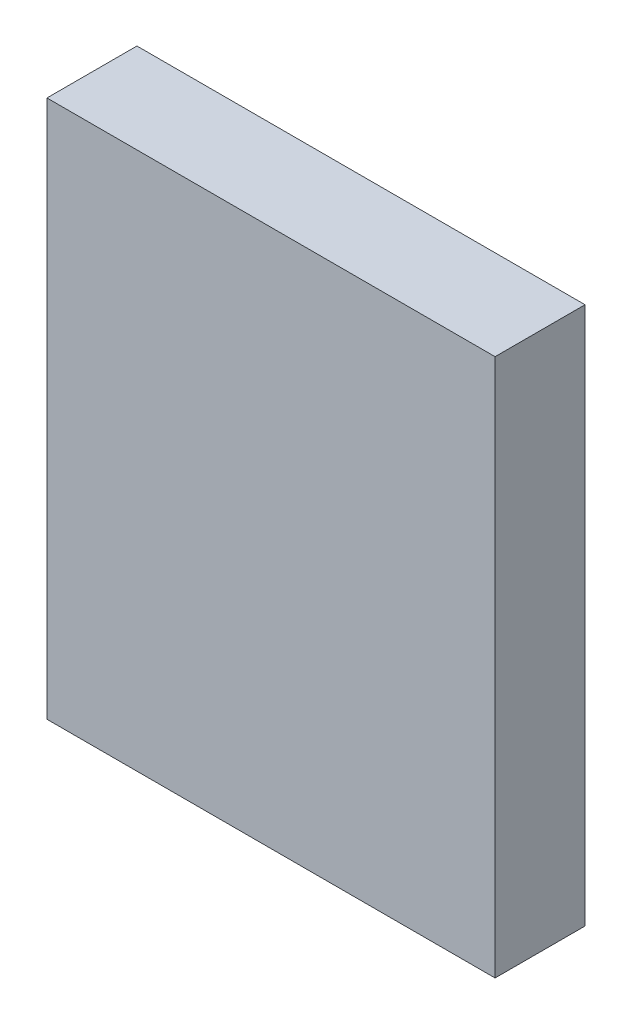
ISO-10303-21;
HEADER;
FILE_DESCRIPTION(('STEP AP214'),'2;1');
FILE_NAME('part.step','',(''),(''),'','','');
FILE_SCHEMA(('AUTOMOTIVE_DESIGN { 1 0 10303 214 1 1 1 1 }'));
ENDSEC;
DATA;
#1=APPLICATION_CONTEXT('core data for automotive mechanical design processes');
#2=APPLICATION_PROTOCOL_DEFINITION('international standard','automotive_design',2000,#1);
#3=PRODUCT_CONTEXT('',#1,'mechanical');
#4=PRODUCT('Part','Part','',(#3));
#5=PRODUCT_RELATED_PRODUCT_CATEGORY('part','',(#4));
#6=PRODUCT_DEFINITION_FORMATION('','',#4);
#7=PRODUCT_DEFINITION_CONTEXT('part definition',#1,'design');
#8=PRODUCT_DEFINITION('design','',#6,#7);
#9=PRODUCT_DEFINITION_SHAPE('','',#8);
#10=(LENGTH_UNIT() NAMED_UNIT(*) SI_UNIT(.MILLI.,.METRE.));
#11=(NAMED_UNIT(*) PLANE_ANGLE_UNIT() SI_UNIT($,.RADIAN.));
#12=(NAMED_UNIT(*) SI_UNIT($,.STERADIAN.) SOLID_ANGLE_UNIT());
#13=UNCERTAINTY_MEASURE_WITH_UNIT(LENGTH_MEASURE(1.E-05),#10,'distance_accuracy_value','');
#14=(GEOMETRIC_REPRESENTATION_CONTEXT(3) GLOBAL_UNCERTAINTY_ASSIGNED_CONTEXT((#13)) GLOBAL_UNIT_ASSIGNED_CONTEXT((#10,
#11,#12)) REPRESENTATION_CONTEXT('',''));
#15=CARTESIAN_POINT('',(0.,0.,0.));
#16=DIRECTION('',(0.,0.,1.));
#17=DIRECTION('',(1.,0.,0.));
#18=AXIS2_PLACEMENT_3D('',#15,#16,#17);
#19=CARTESIAN_POINT('',(-0.627,0.698,0.));
#20=DIRECTION('',(0.,-1.,0.));
#21=DIRECTION('',(0.,0.,1.));
#22=AXIS2_PLACEMENT_3D('',#19,#20,#21);
#23=PLANE('',#22);
#24=DIRECTION('',(-1.,0.,0.));
#25=VECTOR('',#24,1.);
#26=CARTESIAN_POINT('',(-0.373,0.698,0.));
#27=LINE('',#26,#25);
#28=CARTESIAN_POINT('',(-0.373,0.698,0.));
#29=VERTEX_POINT('',#28);
#30=CARTESIAN_POINT('',(-0.627,0.698,0.));
#31=VERTEX_POINT('',#30);
#32=EDGE_CURVE('E11',#29,#31,#27,.T.);
#33=ORIENTED_EDGE('',*,*,#32,.F.);
#34=DIRECTION('',(0.,0.,-1.));
#35=VECTOR('',#34,1.);
#36=CARTESIAN_POINT('',(-0.373,0.698,0.051));
#37=LINE('',#36,#35);
#38=CARTESIAN_POINT('',(-0.373,0.698,0.051));
#39=VERTEX_POINT('',#38);
#40=EDGE_CURVE('E24',#39,#29,#37,.T.);
#41=ORIENTED_EDGE('',*,*,#40,.F.);
#42=DIRECTION('',(1.,0.,0.));
#43=VECTOR('',#42,1.);
#44=CARTESIAN_POINT('',(-0.627,0.698,0.051));
#45=LINE('',#44,#43);
#46=CARTESIAN_POINT('',(-0.627,0.698,0.051));
#47=VERTEX_POINT('',#46);
#48=EDGE_CURVE('E88',#47,#39,#45,.T.);
#49=ORIENTED_EDGE('',*,*,#48,.F.);
#50=DIRECTION('',(0.,0.,1.));
#51=VECTOR('',#50,1.);
#52=CARTESIAN_POINT('',(-0.627,0.698,0.));
#53=LINE('',#52,#51);
#54=EDGE_CURVE('E77',#31,#47,#53,.T.);
#55=ORIENTED_EDGE('',*,*,#54,.F.);
#56=EDGE_LOOP('',(#33,#41,#49,#55));
#57=FACE_BOUND('',#56,.T.);
#58=ADVANCED_FACE('F17',(#57),#23,.T.);
#59=CARTESIAN_POINT('',(-0.373,0.698,0.));
#60=DIRECTION('',(1.,0.,0.));
#61=DIRECTION('',(0.,0.,1.));
#62=AXIS2_PLACEMENT_3D('',#59,#60,#61);
#63=PLANE('',#62);
#64=DIRECTION('',(0.,-1.,0.));
#65=VECTOR('',#64,1.);
#66=CARTESIAN_POINT('',(-0.373,1.003,0.));
#67=LINE('',#66,#65);
#68=CARTESIAN_POINT('',(-0.373,1.003,0.));
#69=VERTEX_POINT('',#68);
#70=EDGE_CURVE('E85',#69,#29,#67,.T.);
#71=ORIENTED_EDGE('',*,*,#70,.F.);
#72=DIRECTION('',(0.,0.,-1.));
#73=VECTOR('',#72,1.);
#74=CARTESIAN_POINT('',(-0.373,1.003,0.051));
#75=LINE('',#74,#73);
#76=CARTESIAN_POINT('',(-0.373,1.003,0.051));
#77=VERTEX_POINT('',#76);
#78=EDGE_CURVE('E83',#77,#69,#75,.T.);
#79=ORIENTED_EDGE('',*,*,#78,.F.);
#80=DIRECTION('',(0.,1.,0.));
#81=VECTOR('',#80,1.);
#82=CARTESIAN_POINT('',(-0.373,0.698,0.051));
#83=LINE('',#82,#81);
#84=EDGE_CURVE('E72',#39,#77,#83,.T.);
#85=ORIENTED_EDGE('',*,*,#84,.F.);
#86=ORIENTED_EDGE('',*,*,#40,.T.);
#87=EDGE_LOOP('',(#71,#79,#85,#86));
#88=FACE_BOUND('',#87,.T.);
#89=ADVANCED_FACE('F90',(#88),#63,.T.);
#90=CARTESIAN_POINT('',(-0.373,1.003,0.));
#91=DIRECTION('',(0.,1.,0.));
#92=DIRECTION('',(0.,0.,1.));
#93=AXIS2_PLACEMENT_3D('',#90,#91,#92);
#94=PLANE('',#93);
#95=DIRECTION('',(1.,0.,0.));
#96=VECTOR('',#95,1.);
#97=CARTESIAN_POINT('',(-0.627,1.003,0.));
#98=LINE('',#97,#96);
#99=CARTESIAN_POINT('',(-0.627,1.003,0.));
#100=VERTEX_POINT('',#99);
#101=EDGE_CURVE('E60',#100,#69,#98,.T.);
#102=ORIENTED_EDGE('',*,*,#101,.F.);
#103=DIRECTION('',(0.,0.,-1.));
#104=VECTOR('',#103,1.);
#105=CARTESIAN_POINT('',(-0.627,1.003,0.051));
#106=LINE('',#105,#104);
#107=CARTESIAN_POINT('',(-0.627,1.003,0.051));
#108=VERTEX_POINT('',#107);
#109=EDGE_CURVE('E54',#108,#100,#106,.T.);
#110=ORIENTED_EDGE('',*,*,#109,.F.);
#111=DIRECTION('',(-1.,0.,0.));
#112=VECTOR('',#111,1.);
#113=CARTESIAN_POINT('',(-0.373,1.003,0.051));
#114=LINE('',#113,#112);
#115=EDGE_CURVE('E58',#77,#108,#114,.T.);
#116=ORIENTED_EDGE('',*,*,#115,.F.);
#117=ORIENTED_EDGE('',*,*,#78,.T.);
#118=EDGE_LOOP('',(#102,#110,#116,#117));
#119=FACE_BOUND('',#118,.T.);
#120=ADVANCED_FACE('F56',(#119),#94,.T.);
#121=CARTESIAN_POINT('',(-0.627,1.003,0.));
#122=DIRECTION('',(-1.,0.,0.));
#123=DIRECTION('',(0.,0.,1.));
#124=AXIS2_PLACEMENT_3D('',#121,#122,#123);
#125=PLANE('',#124);
#126=DIRECTION('',(0.,1.,0.));
#127=VECTOR('',#126,1.);
#128=CARTESIAN_POINT('',(-0.627,0.698,0.));
#129=LINE('',#128,#127);
#130=EDGE_CURVE('E73',#31,#100,#129,.T.);
#131=ORIENTED_EDGE('',*,*,#130,.F.);
#132=ORIENTED_EDGE('',*,*,#54,.T.);
#133=DIRECTION('',(0.,-1.,0.));
#134=VECTOR('',#133,1.);
#135=CARTESIAN_POINT('',(-0.627,1.003,0.051));
#136=LINE('',#135,#134);
#137=EDGE_CURVE('E70',#108,#47,#136,.T.);
#138=ORIENTED_EDGE('',*,*,#137,.F.);
#139=ORIENTED_EDGE('',*,*,#109,.T.);
#140=EDGE_LOOP('',(#131,#132,#138,#139));
#141=FACE_BOUND('',#140,.T.);
#142=ADVANCED_FACE('F76',(#141),#125,.T.);
#143=CARTESIAN_POINT('',(-0.627,1.003,0.));
#144=DIRECTION('',(0.,0.,-1.));
#145=DIRECTION('',(0.,1.,0.));
#146=AXIS2_PLACEMENT_3D('',#143,#144,#145);
#147=PLANE('',#146);
#148=ORIENTED_EDGE('',*,*,#101,.T.);
#149=ORIENTED_EDGE('',*,*,#70,.T.);
#150=ORIENTED_EDGE('',*,*,#32,.T.);
#151=ORIENTED_EDGE('',*,*,#130,.T.);
#152=EDGE_LOOP('',(#148,#149,#150,#151));
#153=FACE_BOUND('',#152,.T.);
#154=ADVANCED_FACE('F91',(#153),#147,.T.);
#155=CARTESIAN_POINT('',(-0.627,0.698,0.051));
#156=DIRECTION('',(0.,0.,1.));
#157=DIRECTION('',(0.,1.,0.));
#158=AXIS2_PLACEMENT_3D('',#155,#156,#157);
#159=PLANE('',#158);
#160=ORIENTED_EDGE('',*,*,#48,.T.);
#161=ORIENTED_EDGE('',*,*,#84,.T.);
#162=ORIENTED_EDGE('',*,*,#115,.T.);
#163=ORIENTED_EDGE('',*,*,#137,.T.);
#164=EDGE_LOOP('',(#160,#161,#162,#163));
#165=FACE_BOUND('',#164,.T.);
#166=ADVANCED_FACE('F69',(#165),#159,.T.);
#167=CLOSED_SHELL('',(#58,#89,#120,#142,#154,#166));
#168=MANIFOLD_SOLID_BREP('B1',#167);
#169=ADVANCED_BREP_SHAPE_REPRESENTATION('',(#18,#168),#14);
#170=SHAPE_DEFINITION_REPRESENTATION(#9,#169);
ENDSEC;
END-ISO-10303-21;
